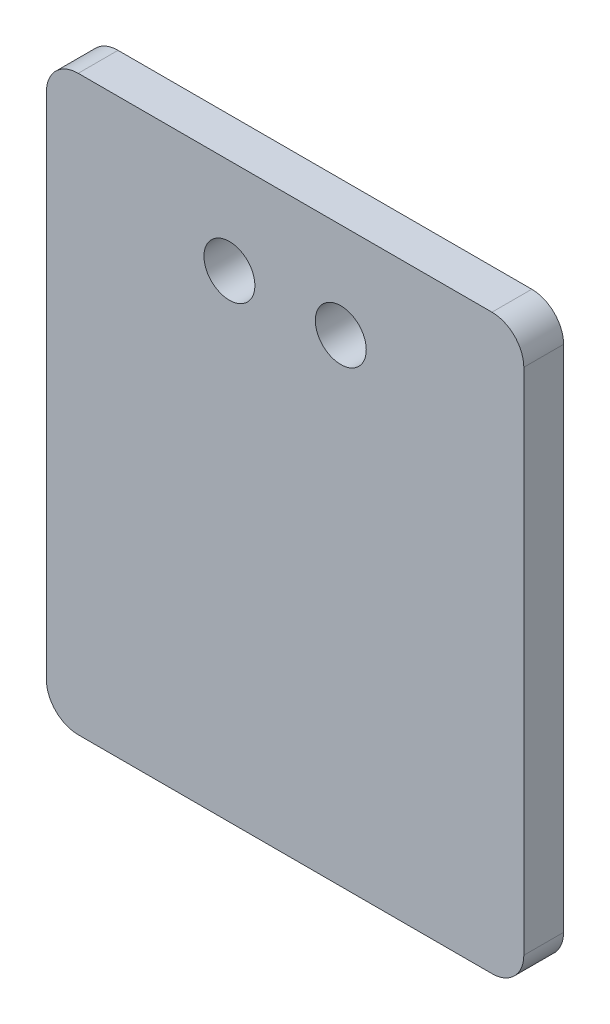
ISO-10303-21;
HEADER;
FILE_DESCRIPTION(('STEP AP214'),'2;1');
FILE_NAME('part.step','',(''),(''),'','','');
FILE_SCHEMA(('AUTOMOTIVE_DESIGN { 1 0 10303 214 1 1 1 1 }'));
ENDSEC;
DATA;
#1=APPLICATION_CONTEXT('core data for automotive mechanical design processes');
#2=APPLICATION_PROTOCOL_DEFINITION('international standard','automotive_design',2000,#1);
#3=PRODUCT_CONTEXT('',#1,'mechanical');
#4=PRODUCT('Part','Part','',(#3));
#5=PRODUCT_RELATED_PRODUCT_CATEGORY('part','',(#4));
#6=PRODUCT_DEFINITION_FORMATION('','',#4);
#7=PRODUCT_DEFINITION_CONTEXT('part definition',#1,'design');
#8=PRODUCT_DEFINITION('design','',#6,#7);
#9=PRODUCT_DEFINITION_SHAPE('','',#8);
#10=(LENGTH_UNIT() NAMED_UNIT(*) SI_UNIT(.MILLI.,.METRE.));
#11=(NAMED_UNIT(*) PLANE_ANGLE_UNIT() SI_UNIT($,.RADIAN.));
#12=(NAMED_UNIT(*) SI_UNIT($,.STERADIAN.) SOLID_ANGLE_UNIT());
#13=UNCERTAINTY_MEASURE_WITH_UNIT(LENGTH_MEASURE(1.E-05),#10,'distance_accuracy_value','');
#14=(GEOMETRIC_REPRESENTATION_CONTEXT(3) GLOBAL_UNCERTAINTY_ASSIGNED_CONTEXT((#13)) GLOBAL_UNIT_ASSIGNED_CONTEXT((#10,
#11,#12)) REPRESENTATION_CONTEXT('',''));
#15=CARTESIAN_POINT('',(0.,0.,0.));
#16=DIRECTION('',(0.,0.,1.));
#17=DIRECTION('',(1.,0.,0.));
#18=AXIS2_PLACEMENT_3D('',#15,#16,#17);
#19=CARTESIAN_POINT('',(0.,0.,2.5));
#20=DIRECTION('',(0.,0.,1.));
#21=DIRECTION('',(1.,0.,0.));
#22=AXIS2_PLACEMENT_3D('',#19,#20,#21);
#23=PLANE('',#22);
#24=CARTESIAN_POINT('',(11.5,-6.,2.5));
#25=DIRECTION('',(0.,0.,1.));
#26=DIRECTION('',(1.,0.,0.));
#27=AXIS2_PLACEMENT_3D('',#24,#25,#26);
#28=CIRCLE('',#27,1.6);
#29=CARTESIAN_POINT('',(13.1,-6.,2.5));
#30=VERTEX_POINT('',#29);
#31=EDGE_CURVE('E180',#30,#30,#28,.T.);
#32=ORIENTED_EDGE('',*,*,#31,.F.);
#33=EDGE_LOOP('',(#32));
#34=FACE_BOUND('',#33,.T.);
#35=DIRECTION('',(1.,0.,0.));
#36=VECTOR('',#35,1.);
#37=CARTESIAN_POINT('',(0.,-36.,2.5));
#38=LINE('',#37,#36);
#39=CARTESIAN_POINT('',(2.,-36.,2.5));
#40=VERTEX_POINT('',#39);
#41=CARTESIAN_POINT('',(28.,-36.,2.5));
#42=VERTEX_POINT('',#41);
#43=EDGE_CURVE('E171',#40,#42,#38,.T.);
#44=ORIENTED_EDGE('',*,*,#43,.T.);
#45=CARTESIAN_POINT('',(28.,-34.,2.5));
#46=DIRECTION('',(0.,0.,1.));
#47=DIRECTION('',(1.,0.,0.));
#48=AXIS2_PLACEMENT_3D('',#45,#46,#47);
#49=CIRCLE('',#48,2.);
#50=CARTESIAN_POINT('',(30.,-34.,2.5));
#51=VERTEX_POINT('',#50);
#52=EDGE_CURVE('E149',#42,#51,#49,.T.);
#53=ORIENTED_EDGE('',*,*,#52,.T.);
#54=DIRECTION('',(0.,1.,0.));
#55=VECTOR('',#54,1.);
#56=CARTESIAN_POINT('',(30.,0.,2.5));
#57=LINE('',#56,#55);
#58=CARTESIAN_POINT('',(30.,-2.,2.5));
#59=VERTEX_POINT('',#58);
#60=EDGE_CURVE('E119',#51,#59,#57,.T.);
#61=ORIENTED_EDGE('',*,*,#60,.T.);
#62=CARTESIAN_POINT('',(28.,-2.,2.5));
#63=DIRECTION('',(0.,0.,1.));
#64=DIRECTION('',(1.,0.,0.));
#65=AXIS2_PLACEMENT_3D('',#62,#63,#64);
#66=CIRCLE('',#65,2.);
#67=CARTESIAN_POINT('',(28.,0.,2.5));
#68=VERTEX_POINT('',#67);
#69=EDGE_CURVE('E55',#59,#68,#66,.T.);
#70=ORIENTED_EDGE('',*,*,#69,.T.);
#71=DIRECTION('',(-1.,0.,0.));
#72=VECTOR('',#71,1.);
#73=CARTESIAN_POINT('',(0.,0.,2.5));
#74=LINE('',#73,#72);
#75=CARTESIAN_POINT('',(2.,0.,2.5));
#76=VERTEX_POINT('',#75);
#77=EDGE_CURVE('E135',#68,#76,#74,.T.);
#78=ORIENTED_EDGE('',*,*,#77,.T.);
#79=CARTESIAN_POINT('',(2.,-2.,2.5));
#80=DIRECTION('',(0.,0.,1.));
#81=DIRECTION('',(1.,0.,0.));
#82=AXIS2_PLACEMENT_3D('',#79,#80,#81);
#83=CIRCLE('',#82,2.);
#84=CARTESIAN_POINT('',(0.,-2.,2.5));
#85=VERTEX_POINT('',#84);
#86=EDGE_CURVE('E145',#76,#85,#83,.T.);
#87=ORIENTED_EDGE('',*,*,#86,.T.);
#88=DIRECTION('',(0.,-1.,0.));
#89=VECTOR('',#88,1.);
#90=CARTESIAN_POINT('',(0.,0.,2.5));
#91=LINE('',#90,#89);
#92=CARTESIAN_POINT('',(0.,-34.,2.5));
#93=VERTEX_POINT('',#92);
#94=EDGE_CURVE('E129',#85,#93,#91,.T.);
#95=ORIENTED_EDGE('',*,*,#94,.T.);
#96=CARTESIAN_POINT('',(2.,-34.,2.5));
#97=DIRECTION('',(0.,0.,1.));
#98=DIRECTION('',(1.,0.,0.));
#99=AXIS2_PLACEMENT_3D('',#96,#97,#98);
#100=CIRCLE('',#99,2.);
#101=EDGE_CURVE('E147',#93,#40,#100,.T.);
#102=ORIENTED_EDGE('',*,*,#101,.T.);
#103=EDGE_LOOP('',(#44,#53,#61,#70,#78,#87,#95,#102));
#104=FACE_BOUND('',#103,.T.);
#105=CARTESIAN_POINT('',(18.5,-6.,2.5));
#106=DIRECTION('',(0.,0.,1.));
#107=DIRECTION('',(1.,0.,0.));
#108=AXIS2_PLACEMENT_3D('',#105,#106,#107);
#109=CIRCLE('',#108,1.6);
#110=CARTESIAN_POINT('',(20.1,-6.,2.5));
#111=VERTEX_POINT('',#110);
#112=EDGE_CURVE('E185',#111,#111,#109,.T.);
#113=ORIENTED_EDGE('',*,*,#112,.F.);
#114=EDGE_LOOP('',(#113));
#115=FACE_BOUND('',#114,.T.);
#116=ADVANCED_FACE('F35',(#34,#104,#115),#23,.T.);
#117=CARTESIAN_POINT('',(0.,0.,0.));
#118=DIRECTION('',(0.,0.,1.));
#119=DIRECTION('',(1.,0.,0.));
#120=AXIS2_PLACEMENT_3D('',#117,#118,#119);
#121=PLANE('',#120);
#122=DIRECTION('',(0.,1.,0.));
#123=VECTOR('',#122,1.);
#124=CARTESIAN_POINT('',(30.,0.,0.));
#125=LINE('',#124,#123);
#126=CARTESIAN_POINT('',(30.,-34.,0.));
#127=VERTEX_POINT('',#126);
#128=CARTESIAN_POINT('',(30.,-2.,0.));
#129=VERTEX_POINT('',#128);
#130=EDGE_CURVE('E117',#127,#129,#125,.T.);
#131=ORIENTED_EDGE('',*,*,#130,.F.);
#132=CARTESIAN_POINT('',(28.,-34.,0.));
#133=DIRECTION('',(0.,0.,1.));
#134=DIRECTION('',(1.,0.,0.));
#135=AXIS2_PLACEMENT_3D('',#132,#133,#134);
#136=CIRCLE('',#135,2.);
#137=CARTESIAN_POINT('',(28.,-36.,0.));
#138=VERTEX_POINT('',#137);
#139=EDGE_CURVE('E100',#127,#138,#136,.F.);
#140=ORIENTED_EDGE('',*,*,#139,.T.);
#141=DIRECTION('',(1.,0.,0.));
#142=VECTOR('',#141,1.);
#143=CARTESIAN_POINT('',(0.,-36.,0.));
#144=LINE('',#143,#142);
#145=CARTESIAN_POINT('',(2.,-36.,0.));
#146=VERTEX_POINT('',#145);
#147=EDGE_CURVE('E127',#146,#138,#144,.T.);
#148=ORIENTED_EDGE('',*,*,#147,.F.);
#149=CARTESIAN_POINT('',(2.,-34.,0.));
#150=DIRECTION('',(0.,0.,1.));
#151=DIRECTION('',(1.,0.,0.));
#152=AXIS2_PLACEMENT_3D('',#149,#150,#151);
#153=CIRCLE('',#152,2.);
#154=CARTESIAN_POINT('',(0.,-34.,0.));
#155=VERTEX_POINT('',#154);
#156=EDGE_CURVE('E111',#146,#155,#153,.F.);
#157=ORIENTED_EDGE('',*,*,#156,.T.);
#158=DIRECTION('',(0.,-1.,0.));
#159=VECTOR('',#158,1.);
#160=CARTESIAN_POINT('',(0.,0.,0.));
#161=LINE('',#160,#159);
#162=CARTESIAN_POINT('',(0.,-2.,0.));
#163=VERTEX_POINT('',#162);
#164=EDGE_CURVE('E131',#163,#155,#161,.T.);
#165=ORIENTED_EDGE('',*,*,#164,.F.);
#166=CARTESIAN_POINT('',(2.,-2.,0.));
#167=DIRECTION('',(0.,0.,1.));
#168=DIRECTION('',(1.,0.,0.));
#169=AXIS2_PLACEMENT_3D('',#166,#167,#168);
#170=CIRCLE('',#169,2.);
#171=CARTESIAN_POINT('',(2.,0.,0.));
#172=VERTEX_POINT('',#171);
#173=EDGE_CURVE('E138',#163,#172,#170,.F.);
#174=ORIENTED_EDGE('',*,*,#173,.T.);
#175=DIRECTION('',(-1.,0.,0.));
#176=VECTOR('',#175,1.);
#177=CARTESIAN_POINT('',(0.,0.,0.));
#178=LINE('',#177,#176);
#179=CARTESIAN_POINT('',(28.,0.,0.));
#180=VERTEX_POINT('',#179);
#181=EDGE_CURVE('E126',#180,#172,#178,.T.);
#182=ORIENTED_EDGE('',*,*,#181,.F.);
#183=CARTESIAN_POINT('',(28.,-2.,0.));
#184=DIRECTION('',(0.,0.,1.));
#185=DIRECTION('',(1.,0.,0.));
#186=AXIS2_PLACEMENT_3D('',#183,#184,#185);
#187=CIRCLE('',#186,2.);
#188=EDGE_CURVE('E120',#180,#129,#187,.F.);
#189=ORIENTED_EDGE('',*,*,#188,.T.);
#190=EDGE_LOOP('',(#131,#140,#148,#157,#165,#174,#182,#189));
#191=FACE_BOUND('',#190,.T.);
#192=CARTESIAN_POINT('',(11.5,-6.,0.));
#193=DIRECTION('',(0.,0.,1.));
#194=DIRECTION('',(1.,0.,0.));
#195=AXIS2_PLACEMENT_3D('',#192,#193,#194);
#196=CIRCLE('',#195,1.6);
#197=CARTESIAN_POINT('',(13.1,-6.,0.));
#198=VERTEX_POINT('',#197);
#199=EDGE_CURVE('E176',#198,#198,#196,.T.);
#200=ORIENTED_EDGE('',*,*,#199,.T.);
#201=EDGE_LOOP('',(#200));
#202=FACE_BOUND('',#201,.T.);
#203=CARTESIAN_POINT('',(18.5,-6.,0.));
#204=DIRECTION('',(0.,0.,1.));
#205=DIRECTION('',(1.,0.,0.));
#206=AXIS2_PLACEMENT_3D('',#203,#204,#205);
#207=CIRCLE('',#206,1.6);
#208=CARTESIAN_POINT('',(20.1,-6.,0.));
#209=VERTEX_POINT('',#208);
#210=EDGE_CURVE('E187',#209,#209,#207,.T.);
#211=ORIENTED_EDGE('',*,*,#210,.T.);
#212=EDGE_LOOP('',(#211));
#213=FACE_BOUND('',#212,.T.);
#214=ADVANCED_FACE('F123',(#191,#202,#213),#121,.F.);
#215=CARTESIAN_POINT('',(0.,0.,2.5));
#216=DIRECTION('',(1.,0.,0.));
#217=DIRECTION('',(0.,1.,0.));
#218=AXIS2_PLACEMENT_3D('',#215,#216,#217);
#219=PLANE('',#218);
#220=ORIENTED_EDGE('',*,*,#164,.T.);
#221=DIRECTION('',(0.,0.,-1.));
#222=VECTOR('',#221,1.);
#223=CARTESIAN_POINT('',(0.,-34.,2.5));
#224=LINE('',#223,#222);
#225=EDGE_CURVE('E154',#155,#93,#224,.F.);
#226=ORIENTED_EDGE('',*,*,#225,.T.);
#227=ORIENTED_EDGE('',*,*,#94,.F.);
#228=DIRECTION('',(0.,0.,-1.));
#229=VECTOR('',#228,1.);
#230=CARTESIAN_POINT('',(0.,-2.,2.5));
#231=LINE('',#230,#229);
#232=EDGE_CURVE('E151',#85,#163,#231,.T.);
#233=ORIENTED_EDGE('',*,*,#232,.T.);
#234=EDGE_LOOP('',(#220,#226,#227,#233));
#235=FACE_BOUND('',#234,.T.);
#236=ADVANCED_FACE('F167',(#235),#219,.F.);
#237=CARTESIAN_POINT('',(0.,-36.,2.5));
#238=DIRECTION('',(0.,1.,0.));
#239=DIRECTION('',(0.,0.,1.));
#240=AXIS2_PLACEMENT_3D('',#237,#238,#239);
#241=PLANE('',#240);
#242=ORIENTED_EDGE('',*,*,#147,.T.);
#243=DIRECTION('',(0.,0.,-1.));
#244=VECTOR('',#243,1.);
#245=CARTESIAN_POINT('',(28.,-36.,2.5));
#246=LINE('',#245,#244);
#247=EDGE_CURVE('E105',#138,#42,#246,.F.);
#248=ORIENTED_EDGE('',*,*,#247,.T.);
#249=ORIENTED_EDGE('',*,*,#43,.F.);
#250=DIRECTION('',(0.,0.,-1.));
#251=VECTOR('',#250,1.);
#252=CARTESIAN_POINT('',(2.,-36.,2.5));
#253=LINE('',#252,#251);
#254=EDGE_CURVE('E110',#40,#146,#253,.T.);
#255=ORIENTED_EDGE('',*,*,#254,.T.);
#256=EDGE_LOOP('',(#242,#248,#249,#255));
#257=FACE_BOUND('',#256,.T.);
#258=ADVANCED_FACE('F212',(#257),#241,.F.);
#259=CARTESIAN_POINT('',(30.,0.,2.5));
#260=DIRECTION('',(-1.,0.,0.));
#261=DIRECTION('',(0.,-1.,0.));
#262=AXIS2_PLACEMENT_3D('',#259,#260,#261);
#263=PLANE('',#262);
#264=ORIENTED_EDGE('',*,*,#60,.F.);
#265=DIRECTION('',(0.,0.,-1.));
#266=VECTOR('',#265,1.);
#267=CARTESIAN_POINT('',(30.,-34.,2.5));
#268=LINE('',#267,#266);
#269=EDGE_CURVE('E104',#51,#127,#268,.T.);
#270=ORIENTED_EDGE('',*,*,#269,.T.);
#271=ORIENTED_EDGE('',*,*,#130,.T.);
#272=DIRECTION('',(0.,0.,-1.));
#273=VECTOR('',#272,1.);
#274=CARTESIAN_POINT('',(30.,-2.,2.5));
#275=LINE('',#274,#273);
#276=EDGE_CURVE('E121',#129,#59,#275,.F.);
#277=ORIENTED_EDGE('',*,*,#276,.T.);
#278=EDGE_LOOP('',(#264,#270,#271,#277));
#279=FACE_BOUND('',#278,.T.);
#280=ADVANCED_FACE('F116',(#279),#263,.F.);
#281=CARTESIAN_POINT('',(0.,0.,2.5));
#282=DIRECTION('',(0.,-1.,0.));
#283=DIRECTION('',(0.,0.,-1.));
#284=AXIS2_PLACEMENT_3D('',#281,#282,#283);
#285=PLANE('',#284);
#286=ORIENTED_EDGE('',*,*,#181,.T.);
#287=DIRECTION('',(0.,0.,-1.));
#288=VECTOR('',#287,1.);
#289=CARTESIAN_POINT('',(2.,0.,2.5));
#290=LINE('',#289,#288);
#291=EDGE_CURVE('E11',#172,#76,#290,.F.);
#292=ORIENTED_EDGE('',*,*,#291,.T.);
#293=ORIENTED_EDGE('',*,*,#77,.F.);
#294=DIRECTION('',(0.,0.,-1.));
#295=VECTOR('',#294,1.);
#296=CARTESIAN_POINT('',(28.,0.,2.5));
#297=LINE('',#296,#295);
#298=EDGE_CURVE('E43',#68,#180,#297,.T.);
#299=ORIENTED_EDGE('',*,*,#298,.T.);
#300=EDGE_LOOP('',(#286,#292,#293,#299));
#301=FACE_BOUND('',#300,.T.);
#302=ADVANCED_FACE('F157',(#301),#285,.F.);
#303=CARTESIAN_POINT('',(11.5,-6.,2.5));
#304=DIRECTION('',(0.,0.,-1.));
#305=DIRECTION('',(-1.,0.,0.));
#306=AXIS2_PLACEMENT_3D('',#303,#304,#305);
#307=CYLINDRICAL_SURFACE('',#306,1.6);
#308=ORIENTED_EDGE('',*,*,#31,.T.);
#309=EDGE_LOOP('',(#308));
#310=FACE_BOUND('',#309,.T.);
#311=ORIENTED_EDGE('',*,*,#199,.F.);
#312=EDGE_LOOP('',(#311));
#313=FACE_BOUND('',#312,.T.);
#314=ADVANCED_FACE('F205',(#310,#313),#307,.F.);
#315=CARTESIAN_POINT('',(18.5,-6.,2.5));
#316=DIRECTION('',(0.,0.,-1.));
#317=DIRECTION('',(-1.,0.,0.));
#318=AXIS2_PLACEMENT_3D('',#315,#316,#317);
#319=CYLINDRICAL_SURFACE('',#318,1.6);
#320=ORIENTED_EDGE('',*,*,#112,.T.);
#321=EDGE_LOOP('',(#320));
#322=FACE_BOUND('',#321,.T.);
#323=ORIENTED_EDGE('',*,*,#210,.F.);
#324=EDGE_LOOP('',(#323));
#325=FACE_BOUND('',#324,.T.);
#326=ADVANCED_FACE('F193',(#322,#325),#319,.F.);
#327=CARTESIAN_POINT('',(28.,-34.,2.5));
#328=DIRECTION('',(0.,0.,-1.));
#329=DIRECTION('',(-1.,0.,0.));
#330=AXIS2_PLACEMENT_3D('',#327,#328,#329);
#331=CYLINDRICAL_SURFACE('',#330,2.);
#332=ORIENTED_EDGE('',*,*,#52,.F.);
#333=ORIENTED_EDGE('',*,*,#247,.F.);
#334=ORIENTED_EDGE('',*,*,#139,.F.);
#335=ORIENTED_EDGE('',*,*,#269,.F.);
#336=EDGE_LOOP('',(#332,#333,#334,#335));
#337=FACE_BOUND('',#336,.T.);
#338=ADVANCED_FACE('F103',(#337),#331,.T.);
#339=CARTESIAN_POINT('',(2.,-34.,2.5));
#340=DIRECTION('',(0.,0.,-1.));
#341=DIRECTION('',(-1.,0.,0.));
#342=AXIS2_PLACEMENT_3D('',#339,#340,#341);
#343=CYLINDRICAL_SURFACE('',#342,2.);
#344=ORIENTED_EDGE('',*,*,#101,.F.);
#345=ORIENTED_EDGE('',*,*,#225,.F.);
#346=ORIENTED_EDGE('',*,*,#156,.F.);
#347=ORIENTED_EDGE('',*,*,#254,.F.);
#348=EDGE_LOOP('',(#344,#345,#346,#347));
#349=FACE_BOUND('',#348,.T.);
#350=ADVANCED_FACE('F220',(#349),#343,.T.);
#351=CARTESIAN_POINT('',(2.,-2.,2.5));
#352=DIRECTION('',(0.,0.,-1.));
#353=DIRECTION('',(-1.,0.,0.));
#354=AXIS2_PLACEMENT_3D('',#351,#352,#353);
#355=CYLINDRICAL_SURFACE('',#354,2.);
#356=ORIENTED_EDGE('',*,*,#86,.F.);
#357=ORIENTED_EDGE('',*,*,#291,.F.);
#358=ORIENTED_EDGE('',*,*,#173,.F.);
#359=ORIENTED_EDGE('',*,*,#232,.F.);
#360=EDGE_LOOP('',(#356,#357,#358,#359));
#361=FACE_BOUND('',#360,.T.);
#362=ADVANCED_FACE('F164',(#361),#355,.T.);
#363=CARTESIAN_POINT('',(28.,-2.,2.5));
#364=DIRECTION('',(0.,0.,-1.));
#365=DIRECTION('',(-1.,0.,0.));
#366=AXIS2_PLACEMENT_3D('',#363,#364,#365);
#367=CYLINDRICAL_SURFACE('',#366,2.);
#368=ORIENTED_EDGE('',*,*,#69,.F.);
#369=ORIENTED_EDGE('',*,*,#276,.F.);
#370=ORIENTED_EDGE('',*,*,#188,.F.);
#371=ORIENTED_EDGE('',*,*,#298,.F.);
#372=EDGE_LOOP('',(#368,#369,#370,#371));
#373=FACE_BOUND('',#372,.T.);
#374=ADVANCED_FACE('F37',(#373),#367,.T.);
#375=CLOSED_SHELL('',(#116,#214,#236,#258,#280,#302,#314,#326,#338,#350,#362,#374));
#376=MANIFOLD_SOLID_BREP('B2',#375);
#377=ADVANCED_BREP_SHAPE_REPRESENTATION('',(#18,#376),#14);
#378=SHAPE_DEFINITION_REPRESENTATION(#9,#377);
ENDSEC;
END-ISO-10303-21;
